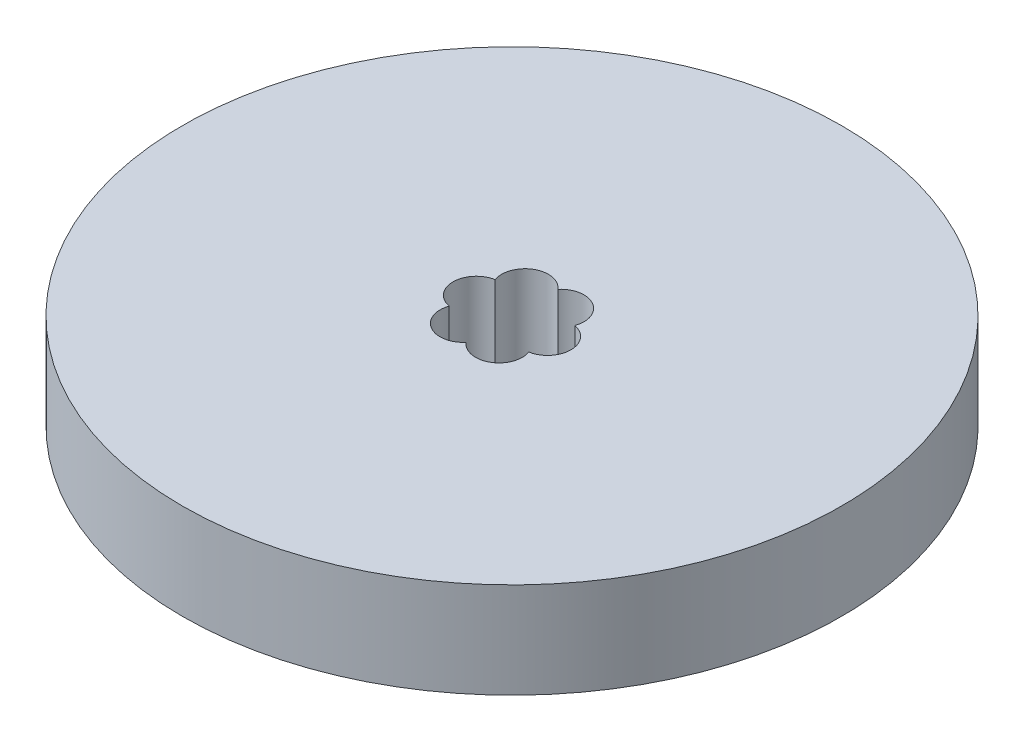
ISO-10303-21;
HEADER;
FILE_DESCRIPTION(('STEP AP214'),'2;1');
FILE_NAME('part.step','',(''),(''),'','','');
FILE_SCHEMA(('AUTOMOTIVE_DESIGN { 1 0 10303 214 1 1 1 1 }'));
ENDSEC;
DATA;
#1=APPLICATION_CONTEXT('core data for automotive mechanical design processes');
#2=APPLICATION_PROTOCOL_DEFINITION('international standard','automotive_design',2000,#1);
#3=PRODUCT_CONTEXT('',#1,'mechanical');
#4=PRODUCT('Part','Part','',(#3));
#5=PRODUCT_RELATED_PRODUCT_CATEGORY('part','',(#4));
#6=PRODUCT_DEFINITION_FORMATION('','',#4);
#7=PRODUCT_DEFINITION_CONTEXT('part definition',#1,'design');
#8=PRODUCT_DEFINITION('design','',#6,#7);
#9=PRODUCT_DEFINITION_SHAPE('','',#8);
#10=(LENGTH_UNIT() NAMED_UNIT(*) SI_UNIT(.MILLI.,.METRE.));
#11=(NAMED_UNIT(*) PLANE_ANGLE_UNIT() SI_UNIT($,.RADIAN.));
#12=(NAMED_UNIT(*) SI_UNIT($,.STERADIAN.) SOLID_ANGLE_UNIT());
#13=UNCERTAINTY_MEASURE_WITH_UNIT(LENGTH_MEASURE(1.E-05),#10,'distance_accuracy_value','');
#14=(GEOMETRIC_REPRESENTATION_CONTEXT(3) GLOBAL_UNCERTAINTY_ASSIGNED_CONTEXT((#13)) GLOBAL_UNIT_ASSIGNED_CONTEXT((#10,
#11,#12)) REPRESENTATION_CONTEXT('',''));
#15=CARTESIAN_POINT('',(0.,0.,0.));
#16=DIRECTION('',(0.,0.,1.));
#17=DIRECTION('',(1.,0.,0.));
#18=AXIS2_PLACEMENT_3D('',#15,#16,#17);
#19=CARTESIAN_POINT('',(0.,29.,0.));
#20=DIRECTION('',(0.,-1.,0.));
#21=DIRECTION('',(0.,0.,-1.));
#22=AXIS2_PLACEMENT_3D('',#19,#20,#21);
#23=CYLINDRICAL_SURFACE('',#22,12.5);
#24=CARTESIAN_POINT('',(0.,0.,0.));
#25=DIRECTION('',(0.,1.,0.));
#26=DIRECTION('',(0.,0.,1.));
#27=AXIS2_PLACEMENT_3D('',#24,#25,#26);
#28=CIRCLE('',#27,12.5);
#29=CARTESIAN_POINT('',(0.,0.,-12.5));
#30=VERTEX_POINT('',#29);
#31=EDGE_CURVE('E142',#30,#30,#28,.T.);
#32=CARTESIAN_POINT('',(0.,4.39133946879396,0.));
#33=DIRECTION('',(0.,1.,0.));
#34=DIRECTION('',(0.,0.,1.));
#35=AXIS2_PLACEMENT_3D('',#32,#33,#34);
#36=CIRCLE('',#35,12.5);
#37=CARTESIAN_POINT('',(0.,4.39133946879396,-12.5));
#38=VERTEX_POINT('',#37);
#39=EDGE_CURVE('E11',#38,#38,#36,.T.);
#40=CARTESIAN_POINT('',(0.,0.,-12.5));
#41=CARTESIAN_POINT('',(0.,0.0457431194666041,-12.5));
#42=CARTESIAN_POINT('',(0.,0.0914862389332083,-12.5));
#43=CARTESIAN_POINT('',(0.,0.182972477866415,-12.5));
#44=CARTESIAN_POINT('',(0.,0.228715597333018,-12.5));
#45=CARTESIAN_POINT('',(0.,0.320201836266226,-12.5));
#46=CARTESIAN_POINT('',(0.,0.36594495573283,-12.5));
#47=CARTESIAN_POINT('',(0.,0.457431194666037,-12.5));
#48=CARTESIAN_POINT('',(0.,0.50317431413264,-12.5));
#49=CARTESIAN_POINT('',(0.,0.594660553065847,-12.5));
#50=CARTESIAN_POINT('',(0.,0.640403672532451,-12.5));
#51=CARTESIAN_POINT('',(0.,0.731889911465659,-12.5));
#52=CARTESIAN_POINT('',(0.,0.777633030932263,-12.5));
#53=CARTESIAN_POINT('',(0.,0.869119269865471,-12.5));
#54=CARTESIAN_POINT('',(0.,0.914862389332074,-12.5));
#55=CARTESIAN_POINT('',(0.,1.00634862826528,-12.5));
#56=CARTESIAN_POINT('',(0.,1.05209174773188,-12.5));
#57=CARTESIAN_POINT('',(0.,1.14357798666509,-12.5));
#58=CARTESIAN_POINT('',(0.,1.1893211061317,-12.5));
#59=CARTESIAN_POINT('',(0.,1.2808073450649,-12.5));
#60=CARTESIAN_POINT('',(0.,1.32655046453151,-12.5));
#61=CARTESIAN_POINT('',(0.,1.41803670346471,-12.5));
#62=CARTESIAN_POINT('',(0.,1.46377982293132,-12.5));
#63=CARTESIAN_POINT('',(0.,1.55526606186453,-12.5));
#64=CARTESIAN_POINT('',(0.,1.60100918133113,-12.5));
#65=CARTESIAN_POINT('',(0.,1.69249542026434,-12.5));
#66=CARTESIAN_POINT('',(0.,1.73823853973094,-12.5));
#67=CARTESIAN_POINT('',(0.,1.82972477866415,-12.5));
#68=CARTESIAN_POINT('',(0.,1.87546789813075,-12.5));
#69=CARTESIAN_POINT('',(0.,1.96695413706396,-12.5));
#70=CARTESIAN_POINT('',(0.,2.01269725653056,-12.5));
#71=CARTESIAN_POINT('',(0.,2.10418349546377,-12.5));
#72=CARTESIAN_POINT('',(0.,2.14992661493037,-12.5));
#73=CARTESIAN_POINT('',(0.,2.24141285386358,-12.5));
#74=CARTESIAN_POINT('',(0.,2.28715597333019,-12.5));
#75=CARTESIAN_POINT('',(0.,2.37864221226339,-12.5));
#76=CARTESIAN_POINT('',(0.,2.42438533173,-12.5));
#77=CARTESIAN_POINT('',(0.,2.5158715706632,-12.5));
#78=CARTESIAN_POINT('',(0.,2.56161469012981,-12.5));
#79=CARTESIAN_POINT('',(0.,2.65310092906301,-12.5));
#80=CARTESIAN_POINT('',(0.,2.69884404852962,-12.5));
#81=CARTESIAN_POINT('',(0.,2.79033028746283,-12.5));
#82=CARTESIAN_POINT('',(0.,2.83607340692943,-12.5));
#83=CARTESIAN_POINT('',(0.,2.92755964586264,-12.5));
#84=CARTESIAN_POINT('',(0.,2.97330276532924,-12.5));
#85=CARTESIAN_POINT('',(0.,3.06478900426245,-12.5));
#86=CARTESIAN_POINT('',(0.,3.11053212372905,-12.5));
#87=CARTESIAN_POINT('',(0.,3.20201836266226,-12.5));
#88=CARTESIAN_POINT('',(0.,3.24776148212886,-12.5));
#89=CARTESIAN_POINT('',(0.,3.33924772106207,-12.5));
#90=CARTESIAN_POINT('',(0.,3.38499084052868,-12.5));
#91=CARTESIAN_POINT('',(0.,3.47647707946188,-12.5));
#92=CARTESIAN_POINT('',(0.,3.52222019892849,-12.5));
#93=CARTESIAN_POINT('',(0.,3.61370643786169,-12.5));
#94=CARTESIAN_POINT('',(0.,3.6594495573283,-12.5));
#95=CARTESIAN_POINT('',(0.,3.7509357962615,-12.5));
#96=CARTESIAN_POINT('',(0.,3.79667891572811,-12.5));
#97=CARTESIAN_POINT('',(0.,3.88816515466132,-12.5));
#98=CARTESIAN_POINT('',(0.,3.93390827412792,-12.5));
#99=CARTESIAN_POINT('',(0.,4.02539451306113,-12.5));
#100=CARTESIAN_POINT('',(0.,4.07113763252773,-12.5));
#101=CARTESIAN_POINT('',(0.,4.16262387146094,-12.5));
#102=CARTESIAN_POINT('',(0.,4.20836699092754,-12.5));
#103=CARTESIAN_POINT('',(0.,4.29985322986075,-12.5));
#104=CARTESIAN_POINT('',(0.,4.34559634932735,-12.5));
#105=CARTESIAN_POINT('',(0.,4.39133946879396,-12.5));
#106=B_SPLINE_CURVE_WITH_KNOTS('',3,(#40,#41,#42,#43,#44,#45,#46,#47,#48,#49,#50,#51,#52,#53,
#54,#55,#56,#57,#58,#59,#60,#61,#62,#63,#64,#65,#66,#67,#68,#69,#70,#71,#72,#73,#74,#75,#76,#77,
#78,#79,#80,#81,#82,#83,#84,#85,#86,#87,#88,#89,#90,#91,#92,#93,#94,#95,#96,#97,#98,#99,#100,
#101,#102,#103,#104,#105),.UNSPECIFIED.,.F.,.F.,(4,2,2,2,2,2,2,2,2,2,2,2,2,2,2,2,2,2,2,2,2,2,2,
2,2,2,2,2,2,2,2,2,4),(0.,0.137229358399812,0.274458716799621,0.411688075199434,
0.548917433599243,0.686146791999055,0.823376150398868,0.960605508798677,1.09783486719849,
1.2350642255983,1.37229358399811,1.50952294239792,1.64675230079774,1.78398165919754,
1.92121101759736,2.05844037599717,2.19566973439698,2.33289909279679,2.4701284511966,
2.60735780959641,2.74458716799622,2.88181652639603,3.01904588479585,3.15627524319565,
3.29350460159547,3.43073395999528,3.56796331839509,3.7051926767949,3.84242203519471,
3.97965139359452,4.11688075199433,4.25411011039414,4.39133946879396),.UNSPECIFIED.);
#107=EDGE_CURVE('BSEAM39',#30,#38,#106,.T.);
#108=ORIENTED_EDGE('',*,*,#31,.F.);
#109=ORIENTED_EDGE('',*,*,#39,.T.);
#110=ORIENTED_EDGE('',*,*,#107,.T.);
#111=ORIENTED_EDGE('',*,*,#107,.F.);
#112=EDGE_LOOP('',(#108,#110,#109,#111));
#113=FACE_BOUND('',#112,.T.);
#114=ADVANCED_FACE('F39',(#113),#23,.F.);
#115=CARTESIAN_POINT('',(0.,29.,0.));
#116=DIRECTION('',(0.,-1.,0.));
#117=DIRECTION('',(0.,0.,-1.));
#118=AXIS2_PLACEMENT_3D('',#115,#116,#117);
#119=CYLINDRICAL_SURFACE('',#118,100.);
#120=CARTESIAN_POINT('',(0.,29.,0.));
#121=DIRECTION('',(0.,1.,0.));
#122=DIRECTION('',(0.,0.,1.));
#123=AXIS2_PLACEMENT_3D('',#120,#121,#122);
#124=CIRCLE('',#123,100.);
#125=CARTESIAN_POINT('',(0.,29.,-100.));
#126=VERTEX_POINT('',#125);
#127=EDGE_CURVE('E50',#126,#126,#124,.T.);
#128=CARTESIAN_POINT('',(0.,0.,0.));
#129=DIRECTION('',(0.,1.,0.));
#130=DIRECTION('',(0.,0.,1.));
#131=AXIS2_PLACEMENT_3D('',#128,#129,#130);
#132=CIRCLE('',#131,100.);
#133=CARTESIAN_POINT('',(0.,0.,-100.));
#134=VERTEX_POINT('',#133);
#135=EDGE_CURVE('E150',#134,#134,#132,.T.);
#136=CARTESIAN_POINT('',(0.,29.,-100.));
#137=CARTESIAN_POINT('',(0.,28.6979166666667,-100.));
#138=CARTESIAN_POINT('',(0.,28.3958333333333,-100.));
#139=CARTESIAN_POINT('',(0.,27.7916666666667,-100.));
#140=CARTESIAN_POINT('',(0.,27.4895833333333,-100.));
#141=CARTESIAN_POINT('',(0.,26.8854166666667,-100.));
#142=CARTESIAN_POINT('',(0.,26.5833333333333,-100.));
#143=CARTESIAN_POINT('',(0.,25.9791666666667,-100.));
#144=CARTESIAN_POINT('',(0.,25.6770833333333,-100.));
#145=CARTESIAN_POINT('',(0.,25.0729166666667,-100.));
#146=CARTESIAN_POINT('',(0.,24.7708333333333,-100.));
#147=CARTESIAN_POINT('',(0.,24.1666666666667,-100.));
#148=CARTESIAN_POINT('',(0.,23.8645833333333,-100.));
#149=CARTESIAN_POINT('',(0.,23.2604166666667,-100.));
#150=CARTESIAN_POINT('',(0.,22.9583333333333,-100.));
#151=CARTESIAN_POINT('',(0.,22.3541666666667,-100.));
#152=CARTESIAN_POINT('',(0.,22.0520833333333,-100.));
#153=CARTESIAN_POINT('',(0.,21.4479166666667,-100.));
#154=CARTESIAN_POINT('',(0.,21.1458333333333,-100.));
#155=CARTESIAN_POINT('',(0.,20.5416666666667,-100.));
#156=CARTESIAN_POINT('',(0.,20.2395833333333,-100.));
#157=CARTESIAN_POINT('',(0.,19.6354166666667,-100.));
#158=CARTESIAN_POINT('',(0.,19.3333333333333,-100.));
#159=CARTESIAN_POINT('',(0.,18.7291666666667,-100.));
#160=CARTESIAN_POINT('',(0.,18.4270833333333,-100.));
#161=CARTESIAN_POINT('',(0.,17.8229166666667,-100.));
#162=CARTESIAN_POINT('',(0.,17.5208333333333,-100.));
#163=CARTESIAN_POINT('',(0.,16.9166666666667,-100.));
#164=CARTESIAN_POINT('',(0.,16.6145833333333,-100.));
#165=CARTESIAN_POINT('',(0.,16.0104166666667,-100.));
#166=CARTESIAN_POINT('',(0.,15.7083333333333,-100.));
#167=CARTESIAN_POINT('',(0.,15.1041666666667,-100.));
#168=CARTESIAN_POINT('',(0.,14.8020833333333,-100.));
#169=CARTESIAN_POINT('',(0.,14.1979166666667,-100.));
#170=CARTESIAN_POINT('',(0.,13.8958333333333,-100.));
#171=CARTESIAN_POINT('',(0.,13.2916666666667,-100.));
#172=CARTESIAN_POINT('',(0.,12.9895833333333,-100.));
#173=CARTESIAN_POINT('',(0.,12.3854166666667,-100.));
#174=CARTESIAN_POINT('',(0.,12.0833333333333,-100.));
#175=CARTESIAN_POINT('',(0.,11.4791666666667,-100.));
#176=CARTESIAN_POINT('',(0.,11.1770833333333,-100.));
#177=CARTESIAN_POINT('',(0.,10.5729166666667,-100.));
#178=CARTESIAN_POINT('',(0.,10.2708333333333,-100.));
#179=CARTESIAN_POINT('',(0.,9.66666666666667,-100.));
#180=CARTESIAN_POINT('',(0.,9.36458333333333,-100.));
#181=CARTESIAN_POINT('',(0.,8.76041666666667,-100.));
#182=CARTESIAN_POINT('',(0.,8.45833333333333,-100.));
#183=CARTESIAN_POINT('',(0.,7.85416666666667,-100.));
#184=CARTESIAN_POINT('',(0.,7.55208333333333,-100.));
#185=CARTESIAN_POINT('',(0.,6.94791666666667,-100.));
#186=CARTESIAN_POINT('',(0.,6.64583333333333,-100.));
#187=CARTESIAN_POINT('',(0.,6.04166666666667,-100.));
#188=CARTESIAN_POINT('',(0.,5.73958333333333,-100.));
#189=CARTESIAN_POINT('',(0.,5.13541666666667,-100.));
#190=CARTESIAN_POINT('',(0.,4.83333333333333,-100.));
#191=CARTESIAN_POINT('',(0.,4.22916666666667,-100.));
#192=CARTESIAN_POINT('',(0.,3.92708333333333,-100.));
#193=CARTESIAN_POINT('',(0.,3.32291666666667,-100.));
#194=CARTESIAN_POINT('',(0.,3.02083333333333,-100.));
#195=CARTESIAN_POINT('',(0.,2.41666666666667,-100.));
#196=CARTESIAN_POINT('',(0.,2.11458333333333,-100.));
#197=CARTESIAN_POINT('',(0.,1.51041666666667,-100.));
#198=CARTESIAN_POINT('',(0.,1.20833333333333,-100.));
#199=CARTESIAN_POINT('',(0.,0.604166666666667,-100.));
#200=CARTESIAN_POINT('',(0.,0.302083333333333,-100.));
#201=CARTESIAN_POINT('',(0.,0.,-100.));
#202=B_SPLINE_CURVE_WITH_KNOTS('',3,(#136,#137,#138,#139,#140,#141,#142,#143,#144,#145,#146,
#147,#148,#149,#150,#151,#152,#153,#154,#155,#156,#157,#158,#159,#160,#161,#162,#163,#164,#165,
#166,#167,#168,#169,#170,#171,#172,#173,#174,#175,#176,#177,#178,#179,#180,#181,#182,#183,#184,
#185,#186,#187,#188,#189,#190,#191,#192,#193,#194,#195,#196,#197,#198,#199,#200,#201),
.UNSPECIFIED.,.F.,.F.,(4,2,2,2,2,2,2,2,2,2,2,2,2,2,2,2,2,2,2,2,2,2,2,2,2,2,2,2,2,2,2,2,4),(0.,
0.906249999999997,1.8125,2.71875,3.625,4.53125,5.4375,6.34375,7.25,8.15625,9.0625,9.96875,
10.875,11.78125,12.6875,13.59375,14.5,15.40625,16.3125,17.21875,18.125,19.03125,19.9375,
20.84375,21.75,22.65625,23.5625,24.46875,25.375,26.28125,27.1875,28.09375,29.),.UNSPECIFIED.);
#203=EDGE_CURVE('BSEAM41',#126,#134,#202,.T.);
#204=ORIENTED_EDGE('',*,*,#127,.F.);
#205=ORIENTED_EDGE('',*,*,#135,.T.);
#206=ORIENTED_EDGE('',*,*,#203,.T.);
#207=ORIENTED_EDGE('',*,*,#203,.F.);
#208=EDGE_LOOP('',(#204,#206,#205,#207));
#209=FACE_BOUND('',#208,.T.);
#210=ADVANCED_FACE('F41',(#209),#119,.T.);
#211=CARTESIAN_POINT('',(0.,29.,0.));
#212=DIRECTION('',(0.,1.,0.));
#213=DIRECTION('',(0.,0.,1.));
#214=AXIS2_PLACEMENT_3D('',#211,#212,#213);
#215=PLANE('',#214);
#216=CARTESIAN_POINT('',(-5.39732775902465,29.,9.34844590373261));
#217=DIRECTION('',(0.,1.,0.));
#218=DIRECTION('',(0.86602540378444,0.,0.499999999999998));
#219=AXIS2_PLACEMENT_3D('',#216,#217,#218);
#220=CIRCLE('',#219,7.08963345942585);
#221=CARTESIAN_POINT('',(-12.0770488772619,29.,6.97268742030346));
#222=VERTEX_POINT('',#221);
#223=CARTESIAN_POINT('',(0.,29.,13.9453748406069));
#224=VERTEX_POINT('',#223);
#225=EDGE_CURVE('E132',#222,#224,#220,.T.);
#226=ORIENTED_EDGE('',*,*,#225,.F.);
#227=CARTESIAN_POINT('',(-10.7946555180493,29.,0.));
#228=DIRECTION('',(0.,1.,0.));
#229=DIRECTION('',(0.,0.,1.));
#230=AXIS2_PLACEMENT_3D('',#227,#228,#229);
#231=CIRCLE('',#230,7.08963345942585);
#232=CARTESIAN_POINT('',(-12.0770488772621,29.,-6.97268742030343));
#233=VERTEX_POINT('',#232);
#234=EDGE_CURVE('E138',#233,#222,#231,.T.);
#235=ORIENTED_EDGE('',*,*,#234,.F.);
#236=CARTESIAN_POINT('',(-5.39732775902478,29.,-9.34844590373254));
#237=DIRECTION('',(0.,1.,0.));
#238=DIRECTION('',(-0.866025403784433,0.,0.50000000000001));
#239=AXIS2_PLACEMENT_3D('',#236,#237,#238);
#240=CIRCLE('',#239,7.08963345942585);
#241=CARTESIAN_POINT('',(-1.45716771982052E-13,29.,-13.9453748406069));
#242=VERTEX_POINT('',#241);
#243=EDGE_CURVE('E53',#242,#233,#240,.T.);
#244=ORIENTED_EDGE('',*,*,#243,.F.);
#245=CARTESIAN_POINT('',(5.39732775902458,29.,-9.34844590373265));
#246=DIRECTION('',(0.,1.,0.));
#247=DIRECTION('',(-0.866025403784443,0.,-0.499999999999992));
#248=AXIS2_PLACEMENT_3D('',#245,#246,#247);
#249=CIRCLE('',#248,7.08963345942585);
#250=CARTESIAN_POINT('',(12.0770488772619,29.,-6.97268742030347));
#251=VERTEX_POINT('',#250);
#252=EDGE_CURVE('E106',#251,#242,#249,.T.);
#253=ORIENTED_EDGE('',*,*,#252,.F.);
#254=CARTESIAN_POINT('',(10.7946555180493,29.,0.));
#255=DIRECTION('',(0.,1.,0.));
#256=DIRECTION('',(0.,0.,-1.));
#257=AXIS2_PLACEMENT_3D('',#254,#255,#256);
#258=CIRCLE('',#257,7.08963345942585);
#259=CARTESIAN_POINT('',(12.077048877262,29.,6.97268742030344));
#260=VERTEX_POINT('',#259);
#261=EDGE_CURVE('E104',#260,#251,#258,.T.);
#262=ORIENTED_EDGE('',*,*,#261,.F.);
#263=CARTESIAN_POINT('',(5.39732775902471,29.,9.34844590373258));
#264=DIRECTION('',(0.,1.,0.));
#265=DIRECTION('',(0.866025403784436,0.,-0.500000000000004));
#266=AXIS2_PLACEMENT_3D('',#263,#264,#265);
#267=CIRCLE('',#266,7.08963345942585);
#268=EDGE_CURVE('E123',#224,#260,#267,.T.);
#269=ORIENTED_EDGE('',*,*,#268,.F.);
#270=EDGE_LOOP('',(#226,#235,#244,#253,#262,#269));
#271=FACE_BOUND('',#270,.T.);
#272=ORIENTED_EDGE('',*,*,#127,.T.);
#273=EDGE_LOOP('',(#272));
#274=FACE_BOUND('',#273,.T.);
#275=ADVANCED_FACE('F156',(#271,#274),#215,.T.);
#276=CARTESIAN_POINT('',(0.,0.,0.));
#277=DIRECTION('',(0.,1.,0.));
#278=DIRECTION('',(0.,0.,1.));
#279=AXIS2_PLACEMENT_3D('',#276,#277,#278);
#280=PLANE('',#279);
#281=ORIENTED_EDGE('',*,*,#31,.T.);
#282=EDGE_LOOP('',(#281));
#283=FACE_BOUND('',#282,.T.);
#284=ORIENTED_EDGE('',*,*,#135,.F.);
#285=EDGE_LOOP('',(#284));
#286=FACE_BOUND('',#285,.T.);
#287=ADVANCED_FACE('F153',(#283,#286),#280,.F.);
#288=CARTESIAN_POINT('',(-10.7946555180493,4.39133946879396,0.));
#289=DIRECTION('',(0.,1.,0.));
#290=DIRECTION('',(0.,0.,1.));
#291=AXIS2_PLACEMENT_3D('',#288,#289,#290);
#292=CYLINDRICAL_SURFACE('',#291,7.08963345942585);
#293=ORIENTED_EDGE('',*,*,#234,.T.);
#294=DIRECTION('',(0.,1.,0.));
#295=VECTOR('',#294,1.);
#296=CARTESIAN_POINT('',(-12.0770488772619,16.695669734397,6.97268742030346));
#297=LINE('',#296,#295);
#298=CARTESIAN_POINT('',(-12.0770488772619,4.39133946879396,6.97268742030346));
#299=VERTEX_POINT('',#298);
#300=EDGE_CURVE('E65',#222,#299,#297,.F.);
#301=ORIENTED_EDGE('',*,*,#300,.T.);
#302=CARTESIAN_POINT('',(-10.7946555180493,4.39133946879396,0.));
#303=DIRECTION('',(0.,1.,0.));
#304=DIRECTION('',(0.,0.,1.));
#305=AXIS2_PLACEMENT_3D('',#302,#303,#304);
#306=CIRCLE('',#305,7.08963345942585);
#307=CARTESIAN_POINT('',(-12.0770488772621,4.39133946879396,-6.97268742030343));
#308=VERTEX_POINT('',#307);
#309=EDGE_CURVE('E139',#308,#299,#306,.T.);
#310=ORIENTED_EDGE('',*,*,#309,.F.);
#311=DIRECTION('',(0.,1.,0.));
#312=VECTOR('',#311,1.);
#313=CARTESIAN_POINT('',(-12.0770488772621,16.695669734397,-6.97268742030343));
#314=LINE('',#313,#312);
#315=EDGE_CURVE('E114',#308,#233,#314,.T.);
#316=ORIENTED_EDGE('',*,*,#315,.T.);
#317=EDGE_LOOP('',(#293,#301,#310,#316));
#318=FACE_BOUND('',#317,.T.);
#319=ADVANCED_FACE('F154',(#318),#292,.F.);
#320=CARTESIAN_POINT('',(-10.7946555180493,4.39133946879396,0.));
#321=DIRECTION('',(0.,1.,0.));
#322=DIRECTION('',(0.,0.,1.));
#323=AXIS2_PLACEMENT_3D('',#320,#321,#322);
#324=PLANE('',#323);
#325=CARTESIAN_POINT('',(-5.39732775902478,4.39133946879396,-9.34844590373254));
#326=DIRECTION('',(0.,1.,0.));
#327=DIRECTION('',(-0.866025403784433,0.,0.50000000000001));
#328=AXIS2_PLACEMENT_3D('',#325,#326,#327);
#329=CIRCLE('',#328,7.08963345942585);
#330=CARTESIAN_POINT('',(-1.45716771982052E-13,4.39133946879396,-13.9453748406069));
#331=VERTEX_POINT('',#330);
#332=EDGE_CURVE('E97',#331,#308,#329,.T.);
#333=ORIENTED_EDGE('',*,*,#332,.T.);
#334=ORIENTED_EDGE('',*,*,#309,.T.);
#335=CARTESIAN_POINT('',(-5.39732775902465,4.39133946879396,9.34844590373261));
#336=DIRECTION('',(0.,1.,0.));
#337=DIRECTION('',(0.86602540378444,0.,0.499999999999998));
#338=AXIS2_PLACEMENT_3D('',#335,#336,#337);
#339=CIRCLE('',#338,7.08963345942585);
#340=CARTESIAN_POINT('',(0.,4.39133946879396,13.9453748406069));
#341=VERTEX_POINT('',#340);
#342=EDGE_CURVE('E133',#299,#341,#339,.T.);
#343=ORIENTED_EDGE('',*,*,#342,.T.);
#344=CARTESIAN_POINT('',(5.39732775902471,4.39133946879396,9.34844590373258));
#345=DIRECTION('',(0.,1.,0.));
#346=DIRECTION('',(0.866025403784436,0.,-0.500000000000004));
#347=AXIS2_PLACEMENT_3D('',#344,#345,#346);
#348=CIRCLE('',#347,7.08963345942585);
#349=CARTESIAN_POINT('',(12.077048877262,4.39133946879396,6.97268742030344));
#350=VERTEX_POINT('',#349);
#351=EDGE_CURVE('E124',#341,#350,#348,.T.);
#352=ORIENTED_EDGE('',*,*,#351,.T.);
#353=CARTESIAN_POINT('',(10.7946555180493,4.39133946879396,0.));
#354=DIRECTION('',(0.,1.,0.));
#355=DIRECTION('',(0.,0.,-1.));
#356=AXIS2_PLACEMENT_3D('',#353,#354,#355);
#357=CIRCLE('',#356,7.08963345942585);
#358=CARTESIAN_POINT('',(12.0770488772619,4.39133946879396,-6.97268742030347));
#359=VERTEX_POINT('',#358);
#360=EDGE_CURVE('E105',#350,#359,#357,.T.);
#361=ORIENTED_EDGE('',*,*,#360,.T.);
#362=CARTESIAN_POINT('',(5.39732775902458,4.39133946879396,-9.34844590373265));
#363=DIRECTION('',(0.,1.,0.));
#364=DIRECTION('',(-0.866025403784443,0.,-0.499999999999992));
#365=AXIS2_PLACEMENT_3D('',#362,#363,#364);
#366=CIRCLE('',#365,7.08963345942585);
#367=EDGE_CURVE('E91',#359,#331,#366,.T.);
#368=ORIENTED_EDGE('',*,*,#367,.T.);
#369=EDGE_LOOP('',(#333,#334,#343,#352,#361,#368));
#370=FACE_BOUND('',#369,.T.);
#371=ORIENTED_EDGE('',*,*,#39,.F.);
#372=EDGE_LOOP('',(#371));
#373=FACE_BOUND('',#372,.T.);
#374=ADVANCED_FACE('F92',(#370,#373),#324,.T.);
#375=CARTESIAN_POINT('',(-5.39732775902465,4.39133946879396,9.34844590373261));
#376=DIRECTION('',(0.,1.,0.));
#377=DIRECTION('',(0.,0.,1.));
#378=AXIS2_PLACEMENT_3D('',#375,#376,#377);
#379=CYLINDRICAL_SURFACE('',#378,7.08963345942585);
#380=ORIENTED_EDGE('',*,*,#225,.T.);
#381=DIRECTION('',(0.,1.,0.));
#382=VECTOR('',#381,1.);
#383=CARTESIAN_POINT('',(0.,16.695669734397,13.9453748406069));
#384=LINE('',#383,#382);
#385=EDGE_CURVE('E128',#224,#341,#384,.F.);
#386=ORIENTED_EDGE('',*,*,#385,.T.);
#387=ORIENTED_EDGE('',*,*,#342,.F.);
#388=ORIENTED_EDGE('',*,*,#300,.F.);
#389=EDGE_LOOP('',(#380,#386,#387,#388));
#390=FACE_BOUND('',#389,.T.);
#391=ADVANCED_FACE('F177',(#390),#379,.F.);
#392=CARTESIAN_POINT('',(-5.39732775902478,4.39133946879396,-9.34844590373254));
#393=DIRECTION('',(0.,1.,0.));
#394=DIRECTION('',(0.,0.,1.));
#395=AXIS2_PLACEMENT_3D('',#392,#393,#394);
#396=CYLINDRICAL_SURFACE('',#395,7.08963345942585);
#397=ORIENTED_EDGE('',*,*,#332,.F.);
#398=DIRECTION('',(0.,1.,0.));
#399=VECTOR('',#398,1.);
#400=CARTESIAN_POINT('',(-1.45716771982052E-13,16.695669734397,-13.9453748406069));
#401=LINE('',#400,#399);
#402=EDGE_CURVE('E107',#242,#331,#401,.F.);
#403=ORIENTED_EDGE('',*,*,#402,.F.);
#404=ORIENTED_EDGE('',*,*,#243,.T.);
#405=ORIENTED_EDGE('',*,*,#315,.F.);
#406=EDGE_LOOP('',(#397,#403,#404,#405));
#407=FACE_BOUND('',#406,.T.);
#408=ADVANCED_FACE('F115',(#407),#396,.F.);
#409=CARTESIAN_POINT('',(5.39732775902471,4.39133946879396,9.34844590373258));
#410=DIRECTION('',(0.,1.,0.));
#411=DIRECTION('',(0.,0.,1.));
#412=AXIS2_PLACEMENT_3D('',#409,#410,#411);
#413=CYLINDRICAL_SURFACE('',#412,7.08963345942585);
#414=ORIENTED_EDGE('',*,*,#268,.T.);
#415=DIRECTION('',(0.,1.,0.));
#416=VECTOR('',#415,1.);
#417=CARTESIAN_POINT('',(12.077048877262,16.695669734397,6.97268742030344));
#418=LINE('',#417,#416);
#419=EDGE_CURVE('E118',#260,#350,#418,.F.);
#420=ORIENTED_EDGE('',*,*,#419,.T.);
#421=ORIENTED_EDGE('',*,*,#351,.F.);
#422=ORIENTED_EDGE('',*,*,#385,.F.);
#423=EDGE_LOOP('',(#414,#420,#421,#422));
#424=FACE_BOUND('',#423,.T.);
#425=ADVANCED_FACE('F182',(#424),#413,.F.);
#426=CARTESIAN_POINT('',(10.7946555180493,4.39133946879396,0.));
#427=DIRECTION('',(0.,1.,0.));
#428=DIRECTION('',(0.,0.,1.));
#429=AXIS2_PLACEMENT_3D('',#426,#427,#428);
#430=CYLINDRICAL_SURFACE('',#429,7.08963345942585);
#431=DIRECTION('',(0.,1.,0.));
#432=VECTOR('',#431,1.);
#433=CARTESIAN_POINT('',(12.0770488772619,16.695669734397,-6.97268742030347));
#434=LINE('',#433,#432);
#435=EDGE_CURVE('E130',#251,#359,#434,.F.);
#436=ORIENTED_EDGE('',*,*,#435,.T.);
#437=ORIENTED_EDGE('',*,*,#360,.F.);
#438=ORIENTED_EDGE('',*,*,#419,.F.);
#439=ORIENTED_EDGE('',*,*,#261,.T.);
#440=EDGE_LOOP('',(#436,#437,#438,#439));
#441=FACE_BOUND('',#440,.T.);
#442=ADVANCED_FACE('F184',(#441),#430,.F.);
#443=CARTESIAN_POINT('',(5.39732775902458,4.39133946879396,-9.34844590373265));
#444=DIRECTION('',(0.,1.,0.));
#445=DIRECTION('',(0.,0.,1.));
#446=AXIS2_PLACEMENT_3D('',#443,#444,#445);
#447=CYLINDRICAL_SURFACE('',#446,7.08963345942585);
#448=ORIENTED_EDGE('',*,*,#252,.T.);
#449=ORIENTED_EDGE('',*,*,#402,.T.);
#450=ORIENTED_EDGE('',*,*,#367,.F.);
#451=ORIENTED_EDGE('',*,*,#435,.F.);
#452=EDGE_LOOP('',(#448,#449,#450,#451));
#453=FACE_BOUND('',#452,.T.);
#454=ADVANCED_FACE('F108',(#453),#447,.F.);
#455=CLOSED_SHELL('',(#114,#210,#275,#287,#319,#374,#391,#408,#425,#442,#454));
#456=MANIFOLD_SOLID_BREP('B2',#455);
#457=ADVANCED_BREP_SHAPE_REPRESENTATION('',(#18,#456),#14);
#458=SHAPE_DEFINITION_REPRESENTATION(#9,#457);
ENDSEC;
END-ISO-10303-21;
